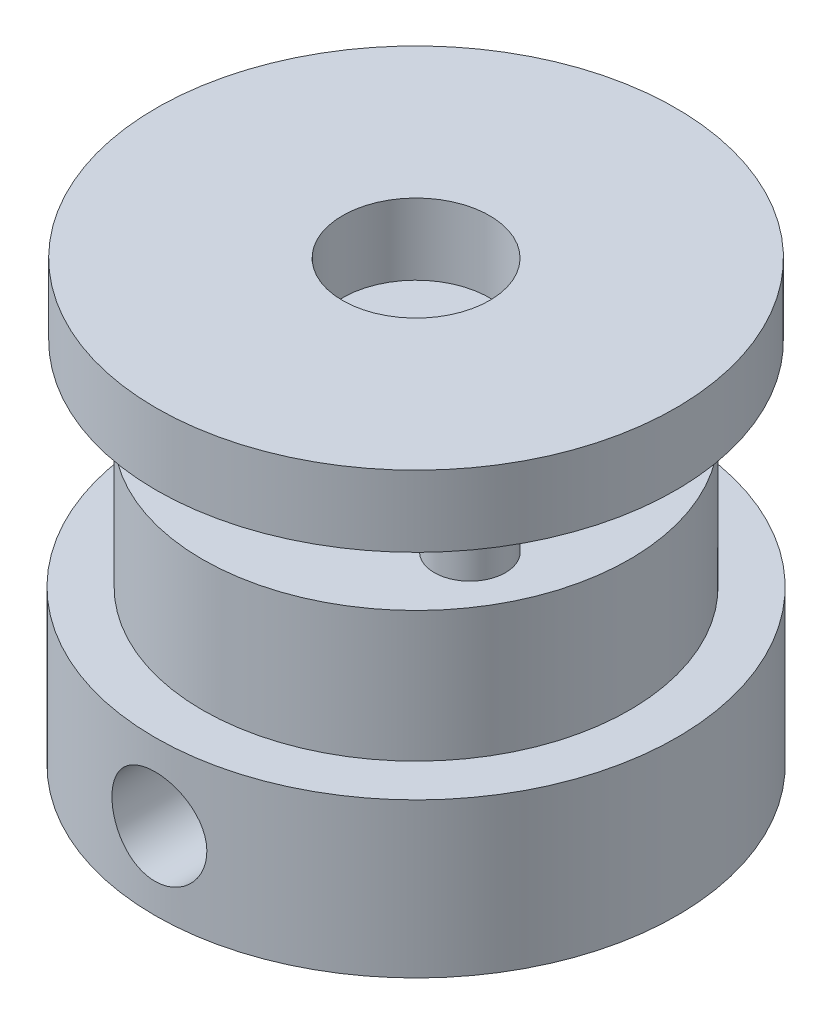
ISO-10303-21;
HEADER;
FILE_DESCRIPTION(('STEP AP214'),'2;1');
FILE_NAME('part.step','',(''),(''),'','','');
FILE_SCHEMA(('AUTOMOTIVE_DESIGN { 1 0 10303 214 1 1 1 1 }'));
ENDSEC;
DATA;
#1=APPLICATION_CONTEXT('core data for automotive mechanical design processes');
#2=APPLICATION_PROTOCOL_DEFINITION('international standard','automotive_design',2000,#1);
#3=PRODUCT_CONTEXT('',#1,'mechanical');
#4=PRODUCT('Part','Part','',(#3));
#5=PRODUCT_RELATED_PRODUCT_CATEGORY('part','',(#4));
#6=PRODUCT_DEFINITION_FORMATION('','',#4);
#7=PRODUCT_DEFINITION_CONTEXT('part definition',#1,'design');
#8=PRODUCT_DEFINITION('design','',#6,#7);
#9=PRODUCT_DEFINITION_SHAPE('','',#8);
#10=(LENGTH_UNIT() NAMED_UNIT(*) SI_UNIT(.MILLI.,.METRE.));
#11=(NAMED_UNIT(*) PLANE_ANGLE_UNIT() SI_UNIT($,.RADIAN.));
#12=(NAMED_UNIT(*) SI_UNIT($,.STERADIAN.) SOLID_ANGLE_UNIT());
#13=UNCERTAINTY_MEASURE_WITH_UNIT(LENGTH_MEASURE(1.E-05),#10,'distance_accuracy_value','');
#14=(GEOMETRIC_REPRESENTATION_CONTEXT(3) GLOBAL_UNCERTAINTY_ASSIGNED_CONTEXT((#13)) GLOBAL_UNIT_ASSIGNED_CONTEXT((#10,
#11,#12)) REPRESENTATION_CONTEXT('',''));
#15=CARTESIAN_POINT('',(0.,0.,0.));
#16=DIRECTION('',(0.,0.,1.));
#17=DIRECTION('',(1.,0.,0.));
#18=AXIS2_PLACEMENT_3D('',#15,#16,#17);
#19=CARTESIAN_POINT('',(0.,6.5,0.));
#20=DIRECTION('',(0.,-1.,0.));
#21=DIRECTION('',(0.,0.,-1.));
#22=AXIS2_PLACEMENT_3D('',#19,#20,#21);
#23=CYLINDRICAL_SURFACE('',#22,11.);
#24=CARTESIAN_POINT('',(0.,6.5,0.));
#25=DIRECTION('',(0.,1.,0.));
#26=DIRECTION('',(0.,0.,1.));
#27=AXIS2_PLACEMENT_3D('',#24,#25,#26);
#28=CIRCLE('',#27,11.);
#29=CARTESIAN_POINT('',(0.,6.5,11.));
#30=VERTEX_POINT('',#29);
#31=EDGE_CURVE('E10',#30,#30,#28,.T.);
#32=ORIENTED_EDGE('',*,*,#31,.F.);
#33=EDGE_LOOP('',(#32));
#34=FACE_BOUND('',#33,.T.);
#35=CARTESIAN_POINT('',(0.,0.,0.));
#36=DIRECTION('',(0.,1.,0.));
#37=DIRECTION('',(0.,0.,1.));
#38=AXIS2_PLACEMENT_3D('',#35,#36,#37);
#39=CIRCLE('',#38,11.);
#40=CARTESIAN_POINT('',(0.,0.,11.));
#41=VERTEX_POINT('',#40);
#42=EDGE_CURVE('E44',#41,#41,#39,.T.);
#43=ORIENTED_EDGE('',*,*,#42,.T.);
#44=EDGE_LOOP('',(#43));
#45=FACE_BOUND('',#44,.T.);
#46=CARTESIAN_POINT('',(0.,1.25,11.));
#47=CARTESIAN_POINT('',(0.111357271644373,1.25000431866068,10.9999980072786));
#48=CARTESIAN_POINT('',(0.222771449918203,1.25933175748265,10.9982915273343));
#49=CARTESIAN_POINT('',(0.442464406848309,1.29637346602492,10.99164847502));
#50=CARTESIAN_POINT('',(0.550740387266074,1.32410364858137,10.9867091072254));
#51=CARTESIAN_POINT('',(0.760947572513748,1.39707712967099,10.9741532323507));
#52=CARTESIAN_POINT('',(0.862884263930176,1.44230503218976,10.9665390793192));
#53=CARTESIAN_POINT('',(1.0577120033845,1.54894733119179,10.949466714983));
#54=CARTESIAN_POINT('',(1.15060386767904,1.61036026518819,10.9400086703132));
#55=CARTESIAN_POINT('',(1.32576444051238,1.74836590964271,10.9201743349983));
#56=CARTESIAN_POINT('',(1.40791622603346,1.82510584198076,10.9097897259708));
#57=CARTESIAN_POINT('',(1.55825357341079,1.99127035408983,10.8893349521181));
#58=CARTESIAN_POINT('',(1.62643816794977,2.08069581168915,10.8792648091126));
#59=CARTESIAN_POINT('',(1.74738695016477,2.27051272945977,10.8604984020977));
#60=CARTESIAN_POINT('',(1.80003313265556,2.37098053523038,10.851812871101));
#61=CARTESIAN_POINT('',(1.88765546949978,2.57951865032397,10.836915832769));
#62=CARTESIAN_POINT('',(1.92263305283275,2.68758834402504,10.8307041253674));
#63=CARTESIAN_POINT('',(1.97355197711315,2.9070146493566,10.8215415351671));
#64=CARTESIAN_POINT('',(1.98969666425445,3.01832259170963,10.8185558462234));
#65=CARTESIAN_POINT('',(2.00312248736688,3.24210440731457,10.8160783143231));
#66=CARTESIAN_POINT('',(2.00040521296643,3.35457818151603,10.8165861769405));
#67=CARTESIAN_POINT('',(1.97634934427,3.57603191413302,10.8210066504918));
#68=CARTESIAN_POINT('',(1.95524117699072,3.68503786789572,10.8248771281426));
#69=CARTESIAN_POINT('',(1.89536523340026,3.89793501836717,10.8355206127391));
#70=CARTESIAN_POINT('',(1.85659674743188,4.00182600935179,10.8422937363232));
#71=CARTESIAN_POINT('',(1.76227297789295,4.20222279077874,10.8580238155272));
#72=CARTESIAN_POINT('',(1.7066239037154,4.29868344266613,10.8669929171435));
#73=CARTESIAN_POINT('',(1.58018503374043,4.48098473694529,10.8860962201172));
#74=CARTESIAN_POINT('',(1.50939379023584,4.56682436264624,10.8962305328347));
#75=CARTESIAN_POINT('',(1.35343399418352,4.72677899644437,10.9167064080854));
#76=CARTESIAN_POINT('',(1.2680681726569,4.80070168843691,10.9270488181647));
#77=CARTESIAN_POINT('',(1.08604454069331,4.93320513348083,10.9466375043709));
#78=CARTESIAN_POINT('',(0.989386629498156,4.99178574962127,10.9558837707156));
#79=CARTESIAN_POINT('',(0.787327598497296,5.09196738978503,10.9722553782534));
#80=CARTESIAN_POINT('',(0.681916780395491,5.13354926869598,10.9793783255922));
#81=CARTESIAN_POINT('',(0.465448414462665,5.1983631924937,10.9906820547088));
#82=CARTESIAN_POINT('',(0.354391431316064,5.22159706857391,10.994863130091));
#83=CARTESIAN_POINT('',(0.131438649578498,5.24878976191912,10.9997719337866));
#84=CARTESIAN_POINT('',(0.0195760121089334,5.25301222345408,11.0005468934114));
#85=CARTESIAN_POINT('',(-0.203257238970968,5.24276820181851,10.998686302475));
#86=CARTESIAN_POINT('',(-0.314227893453082,5.22830257992826,10.9960509090871));
#87=CARTESIAN_POINT('',(-0.531297097592758,5.18131225043812,10.9876950863245));
#88=CARTESIAN_POINT('',(-0.637425297458318,5.14892013081717,10.9819973157216));
#89=CARTESIAN_POINT('',(-0.842744713756611,5.06713917147806,10.9681529512222));
#90=CARTESIAN_POINT('',(-0.941935480960949,5.0177492323023,10.9600061989244));
#91=CARTESIAN_POINT('',(-1.13169524707493,4.90278536219707,10.9420497958484));
#92=CARTESIAN_POINT('',(-1.22216445208488,4.83704931284407,10.932223816146));
#93=CARTESIAN_POINT('',(-1.39088213822347,4.6914796233289,10.9120428807109));
#94=CARTESIAN_POINT('',(-1.46912954974332,4.61164475058806,10.901687878785));
#95=CARTESIAN_POINT('',(-1.6121773788768,4.4389531185515,10.8814603955764));
#96=CARTESIAN_POINT('',(-1.67679836741418,4.34594669347414,10.8715955212189));
#97=CARTESIAN_POINT('',(-1.78949986552014,4.15024381859351,10.8536151008102));
#98=CARTESIAN_POINT('',(-1.83758096630795,4.04754771531562,10.8454994922354));
#99=CARTESIAN_POINT('',(-1.91557945241746,3.83584925030825,10.8319954461548));
#100=CARTESIAN_POINT('',(-1.9455810786184,3.72687876926195,10.8265943801675));
#101=CARTESIAN_POINT('',(-1.98683040178554,3.50533701136893,10.8191012654539));
#102=CARTESIAN_POINT('',(-1.99808007453629,3.39276611515108,10.8170088681136));
#103=CARTESIAN_POINT('',(-2.00144313663184,3.16901462453636,10.8163869388262));
#104=CARTESIAN_POINT('',(-1.99383937001232,3.05783832856146,10.8178047454411));
#105=CARTESIAN_POINT('',(-1.96032846912815,2.83837636198259,10.8239270874703));
#106=CARTESIAN_POINT('',(-1.93442142905718,2.73009067650572,10.8286316059701));
#107=CARTESIAN_POINT('',(-1.86515567158476,2.51962380260463,10.8407757208091));
#108=CARTESIAN_POINT('',(-1.82182581019232,2.41743283977657,10.8482107929975));
#109=CARTESIAN_POINT('',(-1.71897473664823,2.22172555283526,10.8649817751485));
#110=CARTESIAN_POINT('',(-1.65945247569007,2.12820979115441,10.8743178082294));
#111=CARTESIAN_POINT('',(-1.52491543662799,1.95108712540438,10.8940032465147));
#112=CARTESIAN_POINT('',(-1.44969415553099,1.86763843012924,10.9043650783111));
#113=CARTESIAN_POINT('',(-1.28632651423364,1.71445291898781,10.9248399206865));
#114=CARTESIAN_POINT('',(-1.19817718680093,1.64471925960775,10.9349528735191));
#115=CARTESIAN_POINT('',(-1.0105711896463,1.52039970287651,10.9538897429719));
#116=CARTESIAN_POINT('',(-0.911025849790496,1.46594581481987,10.9627021317343));
#117=CARTESIAN_POINT('',(-0.704073905086344,1.37462078392595,10.9779326099335));
#118=CARTESIAN_POINT('',(-0.596674925486669,1.33773284072168,10.9843529858473));
#119=CARTESIAN_POINT('',(-0.407441749458405,1.29022456969781,10.9927407037649));
#120=CARTESIAN_POINT('',(-0.326725427276489,1.27516566703965,10.9954478027358));
#121=CARTESIAN_POINT('',(-0.164016342132202,1.2550519062051,10.9990781643304));
#122=CARTESIAN_POINT('',(-0.0820236084408326,1.24999681895823,11.0000014678));
#123=CARTESIAN_POINT('',(0.,1.25,11.));
#124=B_SPLINE_CURVE_WITH_KNOTS('',3,(#46,#47,#48,#49,#50,#51,#52,#53,#54,#55,#56,#57,#58,#59,
#60,#61,#62,#63,#64,#65,#66,#67,#68,#69,#70,#71,#72,#73,#74,#75,#76,#77,#78,#79,#80,#81,#82,#83,
#84,#85,#86,#87,#88,#89,#90,#91,#92,#93,#94,#95,#96,#97,#98,#99,#100,#101,#102,#103,#104,#105,
#106,#107,#108,#109,#110,#111,#112,#113,#114,#115,#116,#117,#118,#119,#120,#121,#122,#123),
.UNSPECIFIED.,.T.,.F.,(4,2,2,2,2,2,2,2,2,2,2,2,2,2,2,2,2,2,2,2,2,2,2,2,2,2,2,2,2,2,2,2,2,2,2,2,
2,2,4),(0.,0.333771891552332,0.66783277207259,1.00160038286674,1.3353378446015,1.67245014596885,
2.00958578663078,2.3492195220365,2.6888257845573,3.02473021172645,3.36060633024202,
3.69233367290895,4.02407434678871,4.35769306461625,4.69134369321255,5.02993210441872,
5.36852353704646,5.70749527023812,6.04643316861453,6.38065600997364,6.71486344850797,
7.0466314328543,7.37842088074221,7.71364226795666,8.04889297616123,8.38831506130458,
8.72772501252474,9.06554101076157,9.40332141303601,9.73606509730371,10.0688070691931,
10.4010002025896,10.733214857769,11.0701111453004,11.4070848782946,11.7468860454293,
12.0863615649817,12.3322171022956,12.5780670098676),.UNSPECIFIED.);
#125=CARTESIAN_POINT('',(0.,1.25,11.));
#126=VERTEX_POINT('',#125);
#127=EDGE_CURVE('E90',#126,#126,#124,.T.);
#128=ORIENTED_EDGE('',*,*,#127,.F.);
#129=EDGE_LOOP('',(#128));
#130=FACE_BOUND('',#129,.T.);
#131=ADVANCED_FACE('F32',(#34,#45,#130),#23,.T.);
#132=CARTESIAN_POINT('',(0.,0.,0.));
#133=DIRECTION('',(0.,1.,0.));
#134=DIRECTION('',(0.,0.,1.));
#135=AXIS2_PLACEMENT_3D('',#132,#133,#134);
#136=CYLINDRICAL_SURFACE('',#135,3.);
#137=CARTESIAN_POINT('',(0.,0.,0.));
#138=DIRECTION('',(0.,1.,0.));
#139=DIRECTION('',(0.,0.,1.));
#140=AXIS2_PLACEMENT_3D('',#137,#138,#139);
#141=CIRCLE('',#140,3.);
#142=CARTESIAN_POINT('',(0.,0.,3.));
#143=VERTEX_POINT('',#142);
#144=EDGE_CURVE('E54',#143,#143,#141,.T.);
#145=ORIENTED_EDGE('',*,*,#144,.F.);
#146=EDGE_LOOP('',(#145));
#147=FACE_BOUND('',#146,.T.);
#148=CARTESIAN_POINT('',(0.,12.,0.));
#149=DIRECTION('',(0.,1.,0.));
#150=DIRECTION('',(0.,0.,1.));
#151=AXIS2_PLACEMENT_3D('',#148,#149,#150);
#152=CIRCLE('',#151,3.);
#153=CARTESIAN_POINT('',(0.,12.,3.));
#154=VERTEX_POINT('',#153);
#155=EDGE_CURVE('E57',#154,#154,#152,.T.);
#156=ORIENTED_EDGE('',*,*,#155,.T.);
#157=EDGE_LOOP('',(#156));
#158=FACE_BOUND('',#157,.T.);
#159=CARTESIAN_POINT('',(0.,1.25,3.));
#160=CARTESIAN_POINT('',(-0.100484716668078,1.24999945036753,3.0000004164484));
#161=CARTESIAN_POINT('',(-0.200969087132901,1.2576139699555,2.99490802753388));
#162=CARTESIAN_POINT('',(-0.398733058031681,1.28759686410566,2.97504652423809));
#163=CARTESIAN_POINT('',(-0.496011113955007,1.30997224312329,2.96027281581235));
#164=CARTESIAN_POINT('',(-0.684212307854249,1.36810771732484,2.92250482404708));
#165=CARTESIAN_POINT('',(-0.775162872657554,1.40380514000794,2.89954905493315));
#166=CARTESIAN_POINT('',(-0.94941529099726,1.4870633632715,2.8472613787744));
#167=CARTESIAN_POINT('',(-1.03271603160967,1.53462588630056,2.8179285460551));
#168=CARTESIAN_POINT('',(-1.19728470077011,1.64465693736743,2.75227329369838));
#169=CARTESIAN_POINT('',(-1.27778030546067,1.70804786074289,2.71556897579319));
#170=CARTESIAN_POINT('',(-1.42772804469274,1.84573004865845,2.63982313083466));
#171=CARTESIAN_POINT('',(-1.49716405543888,1.92003692983774,2.60077830356832));
#172=CARTESIAN_POINT('',(-1.63422297745496,2.09105236761267,2.51728264678794));
#173=CARTESIAN_POINT('',(-1.6998318636275,2.18944565320345,2.47295067937795));
#174=CARTESIAN_POINT('',(-1.81350357014175,2.39836337764653,2.3908414735282));
#175=CARTESIAN_POINT('',(-1.86159673426503,2.50886640156274,2.35305295954668));
#176=CARTESIAN_POINT('',(-1.92674035011438,2.70671129342162,2.2997626664146));
#177=CARTESIAN_POINT('',(-1.94874447236008,2.79152845287391,2.28097627892403));
#178=CARTESIAN_POINT('',(-1.98150617785228,2.96474450474165,2.25257969659604));
#179=CARTESIAN_POINT('',(-1.99228314651963,3.05313694872606,2.24295368744147));
#180=CARTESIAN_POINT('',(-2.00191364141227,3.23147477885647,2.23436605608045));
#181=CARTESIAN_POINT('',(-2.00071842917524,3.3214250234524,2.23544802558502));
#182=CARTESIAN_POINT('',(-1.98637581333356,3.49963497349975,2.24819775483425));
#183=CARTESIAN_POINT('',(-1.97321828380393,3.58789318202813,2.25987448286881));
#184=CARTESIAN_POINT('',(-1.93664994217326,3.75646705124188,2.29127185989959));
#185=CARTESIAN_POINT('',(-1.91371711479477,3.83696133593877,2.31061488324375));
#186=CARTESIAN_POINT('',(-1.85870118583424,3.99302369097578,2.35509622933623));
#187=CARTESIAN_POINT('',(-1.8266150732855,4.06859013023865,2.3802364585489));
#188=CARTESIAN_POINT('',(-1.74673818732648,4.22902539535644,2.43964196377947));
#189=CARTESIAN_POINT('',(-1.69708052300445,4.31265990048309,2.47472317740626));
#190=CARTESIAN_POINT('',(-1.58668960438221,4.47138339528575,2.54691537733438));
#191=CARTESIAN_POINT('',(-1.52594268999614,4.54646165776207,2.58402882709328));
#192=CARTESIAN_POINT('',(-1.37981165322309,4.70254254560342,2.66543343763724));
#193=CARTESIAN_POINT('',(-1.29193938283656,4.78133404868276,2.7095474472056));
#194=CARTESIAN_POINT('',(-1.10200799908008,4.92319649453848,2.79218100665211));
#195=CARTESIAN_POINT('',(-0.999962299343698,4.98628214540898,2.83070577648042));
#196=CARTESIAN_POINT('',(-0.804857827096532,5.08347771862287,2.89145404090364));
#197=CARTESIAN_POINT('',(-0.713957643371912,5.12084336333894,2.9153926116554));
#198=CARTESIAN_POINT('',(-0.526036043935483,5.18210492562537,2.95507719030499));
#199=CARTESIAN_POINT('',(-0.429019879001652,5.20601222713222,2.97083012127543));
#200=CARTESIAN_POINT('',(-0.230985453172283,5.239161165238,2.99275882156808));
#201=CARTESIAN_POINT('',(-0.12995181193416,5.24833946093826,2.99889322461187));
#202=CARTESIAN_POINT('',(0.0724415193893446,5.25124708856221,3.00083114965147));
#203=CARTESIAN_POINT('',(0.173801186186623,5.24497750048877,2.99663539385634));
#204=CARTESIAN_POINT('',(0.366455717204237,5.21837594443805,2.97899589424273));
#205=CARTESIAN_POINT('',(0.457957444679192,5.19906270224478,2.96622246390226));
#206=CARTESIAN_POINT('',(0.636116392427399,5.14840431398714,2.93318449284837));
#207=CARTESIAN_POINT('',(0.722772837571132,5.11705724907179,2.91291875746989));
#208=CARTESIAN_POINT('',(0.894664750465995,5.04134770295508,2.86496352529158));
#209=CARTESIAN_POINT('',(0.979496184631417,4.99631184591814,2.83689870135785));
#210=CARTESIAN_POINT('',(1.14068302395729,4.89556671005373,2.77601855611511));
#211=CARTESIAN_POINT('',(1.21703314820091,4.83985083946783,2.74320030403941));
#212=CARTESIAN_POINT('',(1.37185445482324,4.70939213184249,2.6695454665343));
#213=CARTESIAN_POINT('',(1.44875187569565,4.63303373992491,2.62826156800165));
#214=CARTESIAN_POINT('',(1.58933968069449,4.46888857004289,2.54571173085958));
#215=CARTESIAN_POINT('',(1.6530209365723,4.3810939608925,2.50444582417845));
#216=CARTESIAN_POINT('',(1.76124776549313,4.20285758723188,2.4293967897058));
#217=CARTESIAN_POINT('',(1.80695636125283,4.11326796653779,2.39527597025701));
#218=CARTESIAN_POINT('',(1.88496213740264,3.92612734755637,2.33438974266155));
#219=CARTESIAN_POINT('',(1.91728345682189,3.82859106169538,2.30761112529822));
#220=CARTESIAN_POINT('',(1.9623584346534,3.64543551280459,2.26933208182633));
#221=CARTESIAN_POINT('',(1.97758597566225,3.56082819012399,2.25594998021257));
#222=CARTESIAN_POINT('',(1.99699205923373,3.38942671868162,2.23879466438398));
#223=CARTESIAN_POINT('',(2.00118260285317,3.3026350488605,2.23501101347816));
#224=CARTESIAN_POINT('',(1.99823921981266,3.1293569432763,2.23764201149981));
#225=CARTESIAN_POINT('',(1.99109858767783,3.04287071862624,2.24406269907463));
#226=CARTESIAN_POINT('',(1.96596997224746,2.87265647146788,2.26610452403491));
#227=CARTESIAN_POINT('',(1.94796751728258,2.78893228617568,2.28173793527615));
#228=CARTESIAN_POINT('',(1.89593035657494,2.60428881351877,2.32526843904801));
#229=CARTESIAN_POINT('',(1.85890187130765,2.50473228705668,2.35532333574983));
#230=CARTESIAN_POINT('',(1.77084526236221,2.3145131656158,2.42222161121309));
#231=CARTESIAN_POINT('',(1.71979748341259,2.22386330200831,2.459074496867));
#232=CARTESIAN_POINT('',(1.60398280555153,2.05071811286377,2.53617186577119));
#233=CARTESIAN_POINT('',(1.53898309894021,1.96840125457695,2.5764658739228));
#234=CARTESIAN_POINT('',(1.39671768031094,1.81467752174207,2.65628301537844));
#235=CARTESIAN_POINT('',(1.31944821025749,1.74327400297079,2.69580590832396));
#236=CARTESIAN_POINT('',(1.14145732976974,1.60328789569092,2.77631551964082));
#237=CARTESIAN_POINT('',(1.03896166955575,1.53658135982168,2.81669805449991));
#238=CARTESIAN_POINT('',(0.820868555771216,1.4220867233347,2.88777665874161));
#239=CARTESIAN_POINT('',(0.705292062449157,1.37426889317605,2.91848793445255));
#240=CARTESIAN_POINT('',(0.491435069835746,1.30884542183622,2.96101644836895));
#241=CARTESIAN_POINT('',(0.395012325257921,1.28688896090138,2.97551480368935));
#242=CARTESIAN_POINT('',(0.199058012023945,1.2574719674619,2.99500280141853));
#243=CARTESIAN_POINT('',(0.0995288361880075,1.25000054440399,2.99999958751315));
#244=CARTESIAN_POINT('',(0.,1.25,3.));
#245=B_SPLINE_CURVE_WITH_KNOTS('',3,(#159,#160,#161,#162,#163,#164,#165,#166,#167,#168,#169,
#170,#171,#172,#173,#174,#175,#176,#177,#178,#179,#180,#181,#182,#183,#184,#185,#186,#187,#188,
#189,#190,#191,#192,#193,#194,#195,#196,#197,#198,#199,#200,#201,#202,#203,#204,#205,#206,#207,
#208,#209,#210,#211,#212,#213,#214,#215,#216,#217,#218,#219,#220,#221,#222,#223,#224,#225,#226,
#227,#228,#229,#230,#231,#232,#233,#234,#235,#236,#237,#238,#239,#240,#241,#242,#243,#244),
.UNSPECIFIED.,.T.,.F.,(4,2,2,2,2,2,2,2,2,2,2,2,2,2,2,2,2,2,2,2,2,2,2,2,2,2,2,2,2,2,2,2,2,2,2,2,
2,2,2,2,2,2,4),(0.,0.3010532265054,0.602249414348688,0.902046153190232,1.20188643867386,
1.52717029000557,1.85292411604319,2.23006683295982,2.60655305445439,2.87433693676029,
3.14165767845809,3.41006711735378,3.67870397263352,3.93548862198022,4.19235783805078,
4.50147574660873,4.81097703780057,5.18718954496752,5.56304840301362,5.86524087696758,
6.16717735142813,6.4704088329425,6.77361911533414,7.05553084792472,7.3374875513827,
7.63652346829516,7.93574454945203,8.28228176141291,8.62905753175757,8.94649935304476,
9.26336626640722,9.52324048016134,9.78283200333091,10.0425772028455,10.302669238524,
10.6320660870419,10.9619271337795,11.2977924520448,11.6337608397015,12.0179535155883,
12.4015390656083,12.6999529136674,12.9981423125957),.UNSPECIFIED.);
#246=CARTESIAN_POINT('',(0.,1.25,3.));
#247=VERTEX_POINT('',#246);
#248=EDGE_CURVE('E36',#247,#247,#245,.T.);
#249=ORIENTED_EDGE('',*,*,#248,.F.);
#250=EDGE_LOOP('',(#249));
#251=FACE_BOUND('',#250,.T.);
#252=ADVANCED_FACE('F130',(#147,#158,#251),#136,.F.);
#253=CARTESIAN_POINT('',(0.,6.5,0.));
#254=DIRECTION('',(0.,1.,0.));
#255=DIRECTION('',(0.,0.,1.));
#256=AXIS2_PLACEMENT_3D('',#253,#254,#255);
#257=PLANE('',#256);
#258=CARTESIAN_POINT('',(0.,6.5,0.));
#259=DIRECTION('',(0.,1.,0.));
#260=DIRECTION('',(0.,0.,1.));
#261=AXIS2_PLACEMENT_3D('',#258,#259,#260);
#262=CIRCLE('',#261,9.);
#263=CARTESIAN_POINT('',(0.,6.5,9.));
#264=VERTEX_POINT('',#263);
#265=EDGE_CURVE('E51',#264,#264,#262,.T.);
#266=ORIENTED_EDGE('',*,*,#265,.F.);
#267=EDGE_LOOP('',(#266));
#268=FACE_BOUND('',#267,.T.);
#269=ORIENTED_EDGE('',*,*,#31,.T.);
#270=EDGE_LOOP('',(#269));
#271=FACE_BOUND('',#270,.T.);
#272=ADVANCED_FACE('F134',(#268,#271),#257,.T.);
#273=CARTESIAN_POINT('',(0.,0.,0.));
#274=DIRECTION('',(0.,1.,0.));
#275=DIRECTION('',(0.,0.,1.));
#276=AXIS2_PLACEMENT_3D('',#273,#274,#275);
#277=PLANE('',#276);
#278=ORIENTED_EDGE('',*,*,#144,.T.);
#279=EDGE_LOOP('',(#278));
#280=FACE_BOUND('',#279,.T.);
#281=ORIENTED_EDGE('',*,*,#42,.F.);
#282=EDGE_LOOP('',(#281));
#283=FACE_BOUND('',#282,.T.);
#284=ADVANCED_FACE('F142',(#280,#283),#277,.F.);
#285=CARTESIAN_POINT('',(0.,12.,0.));
#286=DIRECTION('',(0.,-1.,0.));
#287=DIRECTION('',(0.,0.,-1.));
#288=AXIS2_PLACEMENT_3D('',#285,#286,#287);
#289=CYLINDRICAL_SURFACE('',#288,9.);
#290=CARTESIAN_POINT('',(0.,12.,0.));
#291=DIRECTION('',(0.,1.,0.));
#292=DIRECTION('',(0.,0.,1.));
#293=AXIS2_PLACEMENT_3D('',#290,#291,#292);
#294=CIRCLE('',#293,9.);
#295=CARTESIAN_POINT('',(0.,12.,9.));
#296=VERTEX_POINT('',#295);
#297=EDGE_CURVE('E49',#296,#296,#294,.T.);
#298=ORIENTED_EDGE('',*,*,#297,.F.);
#299=EDGE_LOOP('',(#298));
#300=FACE_BOUND('',#299,.T.);
#301=ORIENTED_EDGE('',*,*,#265,.T.);
#302=EDGE_LOOP('',(#301));
#303=FACE_BOUND('',#302,.T.);
#304=ADVANCED_FACE('F138',(#300,#303),#289,.T.);
#305=CARTESIAN_POINT('',(0.,12.,0.));
#306=DIRECTION('',(0.,1.,0.));
#307=DIRECTION('',(0.,0.,1.));
#308=AXIS2_PLACEMENT_3D('',#305,#306,#307);
#309=PLANE('',#308);
#310=CARTESIAN_POINT('',(5.36935750346355,12.,3.09999999999995));
#311=DIRECTION('',(0.,1.,0.));
#312=DIRECTION('',(-0.866025403784443,0.,-0.499999999999992));
#313=AXIS2_PLACEMENT_3D('',#310,#311,#312);
#314=CIRCLE('',#313,1.5);
#315=CARTESIAN_POINT('',(4.07031939778688,12.,2.34999999999996));
#316=VERTEX_POINT('',#315);
#317=EDGE_CURVE('E75',#316,#316,#314,.T.);
#318=ORIENTED_EDGE('',*,*,#317,.F.);
#319=EDGE_LOOP('',(#318));
#320=FACE_BOUND('',#319,.T.);
#321=CARTESIAN_POINT('',(-5.36935750346351,12.,3.10000000000003));
#322=DIRECTION('',(0.,1.,0.));
#323=DIRECTION('',(0.866025403784436,0.,-0.500000000000004));
#324=AXIS2_PLACEMENT_3D('',#321,#322,#323);
#325=CIRCLE('',#324,1.5);
#326=CARTESIAN_POINT('',(-4.07031939778685,12.,2.35000000000002));
#327=VERTEX_POINT('',#326);
#328=EDGE_CURVE('E69',#327,#327,#325,.T.);
#329=ORIENTED_EDGE('',*,*,#328,.F.);
#330=EDGE_LOOP('',(#329));
#331=FACE_BOUND('',#330,.T.);
#332=CARTESIAN_POINT('',(0.,12.,-6.2));
#333=DIRECTION('',(0.,1.,0.));
#334=DIRECTION('',(0.,0.,1.));
#335=AXIS2_PLACEMENT_3D('',#332,#333,#334);
#336=CIRCLE('',#335,1.5);
#337=CARTESIAN_POINT('',(0.,12.,-4.7));
#338=VERTEX_POINT('',#337);
#339=EDGE_CURVE('E63',#338,#338,#336,.T.);
#340=ORIENTED_EDGE('',*,*,#339,.F.);
#341=EDGE_LOOP('',(#340));
#342=FACE_BOUND('',#341,.T.);
#343=ORIENTED_EDGE('',*,*,#155,.F.);
#344=EDGE_LOOP('',(#343));
#345=FACE_BOUND('',#344,.T.);
#346=ORIENTED_EDGE('',*,*,#297,.T.);
#347=EDGE_LOOP('',(#346));
#348=FACE_BOUND('',#347,.T.);
#349=ADVANCED_FACE('F128',(#320,#331,#342,#345,#348),#309,.T.);
#350=CARTESIAN_POINT('',(0.,15.5,-6.2));
#351=DIRECTION('',(0.,-1.,0.));
#352=DIRECTION('',(0.,0.,-1.));
#353=AXIS2_PLACEMENT_3D('',#350,#351,#352);
#354=CYLINDRICAL_SURFACE('',#353,1.5);
#355=CARTESIAN_POINT('',(0.,15.5,-6.2));
#356=DIRECTION('',(0.,1.,0.));
#357=DIRECTION('',(0.,0.,1.));
#358=AXIS2_PLACEMENT_3D('',#355,#356,#357);
#359=CIRCLE('',#358,1.5);
#360=CARTESIAN_POINT('',(0.,15.5,-4.7));
#361=VERTEX_POINT('',#360);
#362=EDGE_CURVE('E60',#361,#361,#359,.T.);
#363=ORIENTED_EDGE('',*,*,#362,.F.);
#364=EDGE_LOOP('',(#363));
#365=FACE_BOUND('',#364,.T.);
#366=ORIENTED_EDGE('',*,*,#339,.T.);
#367=EDGE_LOOP('',(#366));
#368=FACE_BOUND('',#367,.T.);
#369=ADVANCED_FACE('F125',(#365,#368),#354,.T.);
#370=CARTESIAN_POINT('',(-5.36935750346351,15.5,3.10000000000003));
#371=DIRECTION('',(0.,-1.,0.));
#372=DIRECTION('',(0.,0.,-1.));
#373=AXIS2_PLACEMENT_3D('',#370,#371,#372);
#374=CYLINDRICAL_SURFACE('',#373,1.5);
#375=CARTESIAN_POINT('',(-5.36935750346351,15.5,3.10000000000003));
#376=DIRECTION('',(0.,1.,0.));
#377=DIRECTION('',(0.866025403784436,0.,-0.500000000000004));
#378=AXIS2_PLACEMENT_3D('',#375,#376,#377);
#379=CIRCLE('',#378,1.5);
#380=CARTESIAN_POINT('',(-4.07031939778685,15.5,2.35000000000002));
#381=VERTEX_POINT('',#380);
#382=EDGE_CURVE('E66',#381,#381,#379,.T.);
#383=ORIENTED_EDGE('',*,*,#382,.F.);
#384=EDGE_LOOP('',(#383));
#385=FACE_BOUND('',#384,.T.);
#386=ORIENTED_EDGE('',*,*,#328,.T.);
#387=EDGE_LOOP('',(#386));
#388=FACE_BOUND('',#387,.T.);
#389=ADVANCED_FACE('F121',(#385,#388),#374,.T.);
#390=CARTESIAN_POINT('',(5.36935750346355,15.5,3.09999999999995));
#391=DIRECTION('',(0.,-1.,0.));
#392=DIRECTION('',(0.,0.,-1.));
#393=AXIS2_PLACEMENT_3D('',#390,#391,#392);
#394=CYLINDRICAL_SURFACE('',#393,1.5);
#395=CARTESIAN_POINT('',(5.36935750346355,15.5,3.09999999999995));
#396=DIRECTION('',(0.,1.,0.));
#397=DIRECTION('',(-0.866025403784443,0.,-0.499999999999992));
#398=AXIS2_PLACEMENT_3D('',#395,#396,#397);
#399=CIRCLE('',#398,1.5);
#400=CARTESIAN_POINT('',(4.07031939778688,15.5,2.34999999999996));
#401=VERTEX_POINT('',#400);
#402=EDGE_CURVE('E72',#401,#401,#399,.T.);
#403=ORIENTED_EDGE('',*,*,#402,.F.);
#404=EDGE_LOOP('',(#403));
#405=FACE_BOUND('',#404,.T.);
#406=ORIENTED_EDGE('',*,*,#317,.T.);
#407=EDGE_LOOP('',(#406));
#408=FACE_BOUND('',#407,.T.);
#409=ADVANCED_FACE('F111',(#405,#408),#394,.T.);
#410=CARTESIAN_POINT('',(0.,18.5,0.));
#411=DIRECTION('',(0.,1.,0.));
#412=DIRECTION('',(0.,0.,1.));
#413=AXIS2_PLACEMENT_3D('',#410,#411,#412);
#414=PLANE('',#413);
#415=CARTESIAN_POINT('',(0.,18.5,0.));
#416=DIRECTION('',(0.,1.,0.));
#417=DIRECTION('',(0.,0.,1.));
#418=AXIS2_PLACEMENT_3D('',#415,#416,#417);
#419=CIRCLE('',#418,10.95);
#420=CARTESIAN_POINT('',(0.,18.5,10.95));
#421=VERTEX_POINT('',#420);
#422=EDGE_CURVE('E78',#421,#421,#419,.T.);
#423=ORIENTED_EDGE('',*,*,#422,.T.);
#424=EDGE_LOOP('',(#423));
#425=FACE_BOUND('',#424,.T.);
#426=CARTESIAN_POINT('',(0.,18.5,0.));
#427=DIRECTION('',(0.,1.,0.));
#428=DIRECTION('',(0.,0.,1.));
#429=AXIS2_PLACEMENT_3D('',#426,#427,#428);
#430=CIRCLE('',#429,3.1);
#431=CARTESIAN_POINT('',(0.,18.5,3.1));
#432=VERTEX_POINT('',#431);
#433=EDGE_CURVE('E84',#432,#432,#430,.T.);
#434=ORIENTED_EDGE('',*,*,#433,.F.);
#435=EDGE_LOOP('',(#434));
#436=FACE_BOUND('',#435,.T.);
#437=ADVANCED_FACE('F107',(#425,#436),#414,.T.);
#438=CARTESIAN_POINT('',(0.,15.5,0.));
#439=DIRECTION('',(0.,1.,0.));
#440=DIRECTION('',(0.,0.,1.));
#441=AXIS2_PLACEMENT_3D('',#438,#439,#440);
#442=PLANE('',#441);
#443=ORIENTED_EDGE('',*,*,#362,.T.);
#444=EDGE_LOOP('',(#443));
#445=FACE_BOUND('',#444,.T.);
#446=ORIENTED_EDGE('',*,*,#382,.T.);
#447=EDGE_LOOP('',(#446));
#448=FACE_BOUND('',#447,.T.);
#449=ORIENTED_EDGE('',*,*,#402,.T.);
#450=EDGE_LOOP('',(#449));
#451=FACE_BOUND('',#450,.T.);
#452=CARTESIAN_POINT('',(0.,15.5,0.));
#453=DIRECTION('',(0.,1.,0.));
#454=DIRECTION('',(0.,0.,1.));
#455=AXIS2_PLACEMENT_3D('',#452,#453,#454);
#456=CIRCLE('',#455,10.95);
#457=CARTESIAN_POINT('',(0.,15.5,10.95));
#458=VERTEX_POINT('',#457);
#459=EDGE_CURVE('E81',#458,#458,#456,.T.);
#460=ORIENTED_EDGE('',*,*,#459,.F.);
#461=EDGE_LOOP('',(#460));
#462=FACE_BOUND('',#461,.T.);
#463=CARTESIAN_POINT('',(0.,15.5,0.));
#464=DIRECTION('',(0.,1.,0.));
#465=DIRECTION('',(0.,0.,1.));
#466=AXIS2_PLACEMENT_3D('',#463,#464,#465);
#467=CIRCLE('',#466,3.1);
#468=CARTESIAN_POINT('',(0.,15.5,3.1));
#469=VERTEX_POINT('',#468);
#470=EDGE_CURVE('E87',#469,#469,#467,.T.);
#471=ORIENTED_EDGE('',*,*,#470,.T.);
#472=EDGE_LOOP('',(#471));
#473=FACE_BOUND('',#472,.T.);
#474=ADVANCED_FACE('F110',(#445,#448,#451,#462,#473),#442,.F.);
#475=CARTESIAN_POINT('',(0.,18.5,0.));
#476=DIRECTION('',(0.,-1.,0.));
#477=DIRECTION('',(0.,0.,-1.));
#478=AXIS2_PLACEMENT_3D('',#475,#476,#477);
#479=CYLINDRICAL_SURFACE('',#478,10.95);
#480=ORIENTED_EDGE('',*,*,#422,.F.);
#481=EDGE_LOOP('',(#480));
#482=FACE_BOUND('',#481,.T.);
#483=ORIENTED_EDGE('',*,*,#459,.T.);
#484=EDGE_LOOP('',(#483));
#485=FACE_BOUND('',#484,.T.);
#486=ADVANCED_FACE('F105',(#482,#485),#479,.T.);
#487=CARTESIAN_POINT('',(0.,18.5,0.));
#488=DIRECTION('',(0.,-1.,0.));
#489=DIRECTION('',(0.,0.,-1.));
#490=AXIS2_PLACEMENT_3D('',#487,#488,#489);
#491=CYLINDRICAL_SURFACE('',#490,3.1);
#492=ORIENTED_EDGE('',*,*,#433,.T.);
#493=EDGE_LOOP('',(#492));
#494=FACE_BOUND('',#493,.T.);
#495=ORIENTED_EDGE('',*,*,#470,.F.);
#496=EDGE_LOOP('',(#495));
#497=FACE_BOUND('',#496,.T.);
#498=ADVANCED_FACE('F100',(#494,#497),#491,.F.);
#499=CARTESIAN_POINT('',(0.,3.25,11.));
#500=DIRECTION('',(0.,0.,-1.));
#501=DIRECTION('',(-1.,0.,0.));
#502=AXIS2_PLACEMENT_3D('',#499,#500,#501);
#503=CYLINDRICAL_SURFACE('',#502,2.);
#504=ORIENTED_EDGE('',*,*,#248,.T.);
#505=EDGE_LOOP('',(#504));
#506=FACE_BOUND('',#505,.T.);
#507=ORIENTED_EDGE('',*,*,#127,.T.);
#508=EDGE_LOOP('',(#507));
#509=FACE_BOUND('',#508,.T.);
#510=ADVANCED_FACE('F96',(#506,#509),#503,.F.);
#511=CLOSED_SHELL('',(#131,#252,#272,#284,#304,#349,#369,#389,#409,#437,#474,#486,#498,#510));
#512=MANIFOLD_SOLID_BREP('B2',#511);
#513=ADVANCED_BREP_SHAPE_REPRESENTATION('',(#18,#512),#14);
#514=SHAPE_DEFINITION_REPRESENTATION(#9,#513);
ENDSEC;
END-ISO-10303-21;
